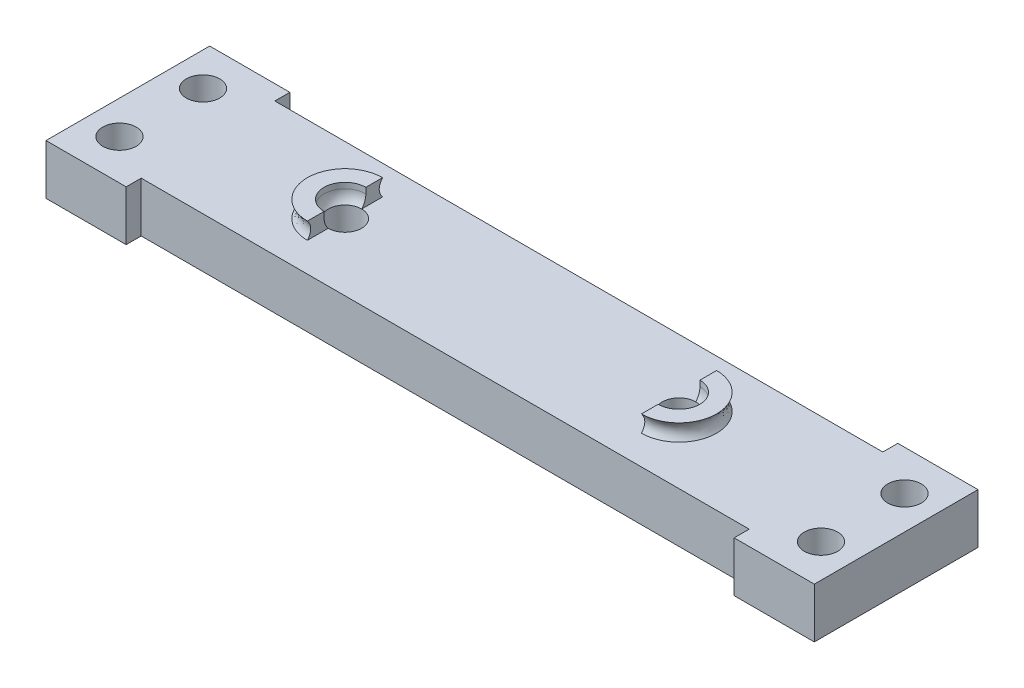
ISO-10303-21;
HEADER;
FILE_DESCRIPTION(('STEP AP214'),'2;1');
FILE_NAME('part.step','',(''),(''),'','','');
FILE_SCHEMA(('AUTOMOTIVE_DESIGN { 1 0 10303 214 1 1 1 1 }'));
ENDSEC;
DATA;
#1=APPLICATION_CONTEXT('core data for automotive mechanical design processes');
#2=APPLICATION_PROTOCOL_DEFINITION('international standard','automotive_design',2000,#1);
#3=PRODUCT_CONTEXT('',#1,'mechanical');
#4=PRODUCT('Part','Part','',(#3));
#5=PRODUCT_RELATED_PRODUCT_CATEGORY('part','',(#4));
#6=PRODUCT_DEFINITION_FORMATION('','',#4);
#7=PRODUCT_DEFINITION_CONTEXT('part definition',#1,'design');
#8=PRODUCT_DEFINITION('design','',#6,#7);
#9=PRODUCT_DEFINITION_SHAPE('','',#8);
#10=(LENGTH_UNIT() NAMED_UNIT(*) SI_UNIT(.MILLI.,.METRE.));
#11=(NAMED_UNIT(*) PLANE_ANGLE_UNIT() SI_UNIT($,.RADIAN.));
#12=(NAMED_UNIT(*) SI_UNIT($,.STERADIAN.) SOLID_ANGLE_UNIT());
#13=UNCERTAINTY_MEASURE_WITH_UNIT(LENGTH_MEASURE(1.E-05),#10,'distance_accuracy_value','');
#14=(GEOMETRIC_REPRESENTATION_CONTEXT(3) GLOBAL_UNCERTAINTY_ASSIGNED_CONTEXT((#13)) GLOBAL_UNIT_ASSIGNED_CONTEXT((#10,
#11,#12)) REPRESENTATION_CONTEXT('',''));
#15=CARTESIAN_POINT('',(0.,0.,0.));
#16=DIRECTION('',(0.,0.,1.));
#17=DIRECTION('',(1.,0.,0.));
#18=AXIS2_PLACEMENT_3D('',#15,#16,#17);
#19=CARTESIAN_POINT('',(3.00570826429431,5.,1.75));
#20=DIRECTION('',(1.,0.,0.));
#21=DIRECTION('',(0.,0.,-1.));
#22=AXIS2_PLACEMENT_3D('',#19,#20,#21);
#23=PLANE('',#22);
#24=CARTESIAN_POINT('',(3.00570826429431,4.,1.75));
#25=CARTESIAN_POINT('',(3.00570826429431,4.5,2.15));
#26=CARTESIAN_POINT('',(3.00570826429431,5.,1.75));
#27=B_SPLINE_CURVE_WITH_KNOTS('',2,(#24,#25,#26),.UNSPECIFIED.,.F.,.F.,(3,3),(0.,1.),.UNSPECIFIED.);
#28=CARTESIAN_POINT('',(3.00570826429431,4.,1.75));
#29=VERTEX_POINT('',#28);
#30=CARTESIAN_POINT('',(3.00570826429431,5.,1.75));
#31=VERTEX_POINT('',#30);
#32=EDGE_CURVE('E314',#29,#31,#27,.T.);
#33=ORIENTED_EDGE('',*,*,#32,.F.);
#34=DIRECTION('',(0.,0.,1.));
#35=VECTOR('',#34,1.);
#36=CARTESIAN_POINT('',(3.00570826429431,4.,1.75));
#37=LINE('',#36,#35);
#38=CARTESIAN_POINT('',(3.00570826429431,4.,3.00000000000001));
#39=VERTEX_POINT('',#38);
#40=EDGE_CURVE('E49',#29,#39,#37,.T.);
#41=ORIENTED_EDGE('',*,*,#40,.T.);
#42=CARTESIAN_POINT('',(3.00570826429431,4.66143782776615,3.75));
#43=DIRECTION('',(1.,0.,0.));
#44=DIRECTION('',(0.,0.,-1.));
#45=AXIS2_PLACEMENT_3D('',#42,#43,#44);
#46=CIRCLE('',#45,1.);
#47=CARTESIAN_POINT('',(3.00570826429431,4.66143782776615,2.75));
#48=VERTEX_POINT('',#47);
#49=EDGE_CURVE('E11',#39,#48,#46,.T.);
#50=ORIENTED_EDGE('',*,*,#49,.T.);
#51=DIRECTION('',(0.,-1.,0.));
#52=VECTOR('',#51,1.);
#53=CARTESIAN_POINT('',(3.00570826429431,5.,2.75));
#54=LINE('',#53,#52);
#55=CARTESIAN_POINT('',(3.00570826429431,5.,2.75));
#56=VERTEX_POINT('',#55);
#57=EDGE_CURVE('E353',#56,#48,#54,.T.);
#58=ORIENTED_EDGE('',*,*,#57,.F.);
#59=DIRECTION('',(0.,0.,1.));
#60=VECTOR('',#59,1.);
#61=CARTESIAN_POINT('',(3.00570826429431,5.,1.75));
#62=LINE('',#61,#60);
#63=EDGE_CURVE('E340',#31,#56,#62,.T.);
#64=ORIENTED_EDGE('',*,*,#63,.F.);
#65=EDGE_LOOP('',(#33,#41,#50,#58,#64));
#66=FACE_BOUND('',#65,.T.);
#67=ADVANCED_FACE('F35',(#66),#23,.F.);
#68=CARTESIAN_POINT('',(3.00570826429431,5.,5.25));
#69=DIRECTION('',(1.,0.,0.));
#70=DIRECTION('',(0.,0.,-1.));
#71=AXIS2_PLACEMENT_3D('',#68,#69,#70);
#72=PLANE('',#71);
#73=CARTESIAN_POINT('',(3.00570826429431,4.,6.25000000000001));
#74=CARTESIAN_POINT('',(3.00570826429431,4.5,5.85000000000001));
#75=CARTESIAN_POINT('',(3.00570826429431,5.,6.25000000000001));
#76=B_SPLINE_CURVE_WITH_KNOTS('',2,(#73,#74,#75),.UNSPECIFIED.,.F.,.F.,(3,3),(0.,1.),.UNSPECIFIED.);
#77=CARTESIAN_POINT('',(3.00570826429431,5.,6.25000000000001));
#78=VERTEX_POINT('',#77);
#79=CARTESIAN_POINT('',(3.00570826429431,4.,6.25000000000001));
#80=VERTEX_POINT('',#79);
#81=EDGE_CURVE('E284',#78,#80,#76,.F.);
#82=ORIENTED_EDGE('',*,*,#81,.F.);
#83=DIRECTION('',(0.,0.,1.));
#84=VECTOR('',#83,1.);
#85=CARTESIAN_POINT('',(3.00570826429431,5.,5.25));
#86=LINE('',#85,#84);
#87=CARTESIAN_POINT('',(3.00570826429431,5.,5.25000000000001));
#88=VERTEX_POINT('',#87);
#89=EDGE_CURVE('E344',#88,#78,#86,.T.);
#90=ORIENTED_EDGE('',*,*,#89,.F.);
#91=DIRECTION('',(0.,-1.,0.));
#92=VECTOR('',#91,1.);
#93=CARTESIAN_POINT('',(3.00570826429431,5.,5.25000000000001));
#94=LINE('',#93,#92);
#95=CARTESIAN_POINT('',(3.00570826429431,4.66143782776615,5.25000000000001));
#96=VERTEX_POINT('',#95);
#97=EDGE_CURVE('E347',#88,#96,#94,.T.);
#98=ORIENTED_EDGE('',*,*,#97,.T.);
#99=CARTESIAN_POINT('',(3.00570826429431,4.66143782776615,4.25000000000001));
#100=DIRECTION('',(1.,0.,0.));
#101=DIRECTION('',(0.,0.,-1.));
#102=AXIS2_PLACEMENT_3D('',#99,#100,#101);
#103=CIRCLE('',#102,1.);
#104=CARTESIAN_POINT('',(3.00570826429431,4.,5.00000000000001));
#105=VERTEX_POINT('',#104);
#106=EDGE_CURVE('E43',#96,#105,#103,.T.);
#107=ORIENTED_EDGE('',*,*,#106,.T.);
#108=DIRECTION('',(0.,0.,1.));
#109=VECTOR('',#108,1.);
#110=CARTESIAN_POINT('',(3.00570826429431,4.,5.25));
#111=LINE('',#110,#109);
#112=EDGE_CURVE('E56',#105,#80,#111,.T.);
#113=ORIENTED_EDGE('',*,*,#112,.T.);
#114=EDGE_LOOP('',(#82,#90,#98,#107,#113));
#115=FACE_BOUND('',#114,.T.);
#116=ADVANCED_FACE('F422',(#115),#72,.F.);
#117=CARTESIAN_POINT('',(0.,4.,0.));
#118=DIRECTION('',(0.,1.,0.));
#119=DIRECTION('',(0.,0.,1.));
#120=AXIS2_PLACEMENT_3D('',#117,#118,#119);
#121=PLANE('',#120);
#122=DIRECTION('',(0.,0.,-1.));
#123=VECTOR('',#122,1.);
#124=CARTESIAN_POINT('',(-16.9942917357057,4.,1.75000000000001));
#125=LINE('',#124,#123);
#126=CARTESIAN_POINT('',(-16.9942917357057,4.,3.));
#127=VERTEX_POINT('',#126);
#128=CARTESIAN_POINT('',(-16.9942917357057,4.,1.75000000000001));
#129=VERTEX_POINT('',#128);
#130=EDGE_CURVE('E361',#127,#129,#125,.T.);
#131=ORIENTED_EDGE('',*,*,#130,.F.);
#132=CARTESIAN_POINT('',(-16.9942917357057,4.,4.00000000000001));
#133=DIRECTION('',(0.,1.,0.));
#134=DIRECTION('',(0.,0.,1.));
#135=AXIS2_PLACEMENT_3D('',#132,#133,#134);
#136=CIRCLE('',#135,1.);
#137=CARTESIAN_POINT('',(-16.9942917357057,4.,5.00000000000001));
#138=VERTEX_POINT('',#137);
#139=EDGE_CURVE('E246',#138,#127,#136,.T.);
#140=ORIENTED_EDGE('',*,*,#139,.F.);
#141=DIRECTION('',(0.,0.,-1.));
#142=VECTOR('',#141,1.);
#143=CARTESIAN_POINT('',(-16.9942917357057,4.,6.25000000000001));
#144=LINE('',#143,#142);
#145=CARTESIAN_POINT('',(-16.9942917357057,4.,6.25000000000001));
#146=VERTEX_POINT('',#145);
#147=EDGE_CURVE('E370',#146,#138,#144,.T.);
#148=ORIENTED_EDGE('',*,*,#147,.F.);
#149=CARTESIAN_POINT('',(-16.9942917357057,4.,4.00000000000001));
#150=DIRECTION('',(0.,1.,0.));
#151=DIRECTION('',(0.,0.,1.));
#152=AXIS2_PLACEMENT_3D('',#149,#150,#151);
#153=CIRCLE('',#152,2.25);
#154=EDGE_CURVE('E356',#129,#146,#153,.T.);
#155=ORIENTED_EDGE('',*,*,#154,.F.);
#156=EDGE_LOOP('',(#131,#140,#148,#155));
#157=FACE_BOUND('',#156,.T.);
#158=ORIENTED_EDGE('',*,*,#112,.F.);
#159=CARTESIAN_POINT('',(3.00570826429431,4.,4.00000000000001));
#160=DIRECTION('',(0.,1.,0.));
#161=DIRECTION('',(0.,0.,1.));
#162=AXIS2_PLACEMENT_3D('',#159,#160,#161);
#163=CIRCLE('',#162,1.);
#164=EDGE_CURVE('E249',#39,#105,#163,.T.);
#165=ORIENTED_EDGE('',*,*,#164,.F.);
#166=ORIENTED_EDGE('',*,*,#40,.F.);
#167=CARTESIAN_POINT('',(3.00570826429431,4.,4.00000000000001));
#168=DIRECTION('',(0.,1.,0.));
#169=DIRECTION('',(0.,0.,-1.));
#170=AXIS2_PLACEMENT_3D('',#167,#168,#169);
#171=CIRCLE('',#170,2.25);
#172=EDGE_CURVE('E333',#80,#29,#171,.T.);
#173=ORIENTED_EDGE('',*,*,#172,.F.);
#174=EDGE_LOOP('',(#158,#165,#166,#173));
#175=FACE_BOUND('',#174,.T.);
#176=DIRECTION('',(1.,0.,0.));
#177=VECTOR('',#176,1.);
#178=CARTESIAN_POINT('',(0.,4.,-0.899999999999998));
#179=LINE('',#178,#177);
#180=CARTESIAN_POINT('',(-29.9942917357057,4.,-0.900000000000001));
#181=VERTEX_POINT('',#180);
#182=CARTESIAN_POINT('',(-25.1942917357057,4.,-0.900000000000001));
#183=VERTEX_POINT('',#182);
#184=EDGE_CURVE('E194',#181,#183,#179,.T.);
#185=ORIENTED_EDGE('',*,*,#184,.F.);
#186=DIRECTION('',(0.,0.,1.));
#187=VECTOR('',#186,1.);
#188=CARTESIAN_POINT('',(-29.9942917357057,4.,-0.999999999999999));
#189=LINE('',#188,#187);
#190=CARTESIAN_POINT('',(-29.9942917357057,4.,8.90000000000001));
#191=VERTEX_POINT('',#190);
#192=EDGE_CURVE('E191',#181,#191,#189,.T.);
#193=ORIENTED_EDGE('',*,*,#192,.T.);
#194=DIRECTION('',(-1.,0.,0.));
#195=VECTOR('',#194,1.);
#196=CARTESIAN_POINT('',(0.,4.,8.90000000000001));
#197=LINE('',#196,#195);
#198=CARTESIAN_POINT('',(-25.1942917357057,4.,8.90000000000001));
#199=VERTEX_POINT('',#198);
#200=EDGE_CURVE('E255',#199,#191,#197,.T.);
#201=ORIENTED_EDGE('',*,*,#200,.F.);
#202=DIRECTION('',(0.,0.,1.));
#203=VECTOR('',#202,1.);
#204=CARTESIAN_POINT('',(-25.1942917357057,4.,0.));
#205=LINE('',#204,#203);
#206=CARTESIAN_POINT('',(-25.1942917357057,4.,8.00000000000001));
#207=VERTEX_POINT('',#206);
#208=EDGE_CURVE('E281',#207,#199,#205,.T.);
#209=ORIENTED_EDGE('',*,*,#208,.F.);
#210=DIRECTION('',(1.,0.,0.));
#211=VECTOR('',#210,1.);
#212=CARTESIAN_POINT('',(11.0057082642943,4.,8.));
#213=LINE('',#212,#211);
#214=CARTESIAN_POINT('',(11.2057082642943,4.,8.));
#215=VERTEX_POINT('',#214);
#216=EDGE_CURVE('E392',#207,#215,#213,.T.);
#217=ORIENTED_EDGE('',*,*,#216,.T.);
#218=DIRECTION('',(0.,0.,-1.));
#219=VECTOR('',#218,1.);
#220=CARTESIAN_POINT('',(11.2057082642943,4.,0.));
#221=LINE('',#220,#219);
#222=CARTESIAN_POINT('',(11.2057082642943,4.,8.9));
#223=VERTEX_POINT('',#222);
#224=EDGE_CURVE('E273',#223,#215,#221,.T.);
#225=ORIENTED_EDGE('',*,*,#224,.F.);
#226=DIRECTION('',(-1.,0.,0.));
#227=VECTOR('',#226,1.);
#228=CARTESIAN_POINT('',(0.,4.,8.9));
#229=LINE('',#228,#227);
#230=CARTESIAN_POINT('',(16.0057082642943,4.,8.9));
#231=VERTEX_POINT('',#230);
#232=EDGE_CURVE('E264',#231,#223,#229,.T.);
#233=ORIENTED_EDGE('',*,*,#232,.F.);
#234=DIRECTION('',(0.,0.,-1.));
#235=VECTOR('',#234,1.);
#236=CARTESIAN_POINT('',(16.0057082642943,4.,9.));
#237=LINE('',#236,#235);
#238=CARTESIAN_POINT('',(16.0057082642943,4.,-0.900000000000004));
#239=VERTEX_POINT('',#238);
#240=EDGE_CURVE('E395',#231,#239,#237,.T.);
#241=ORIENTED_EDGE('',*,*,#240,.T.);
#242=DIRECTION('',(1.,0.,0.));
#243=VECTOR('',#242,1.);
#244=CARTESIAN_POINT('',(0.,4.,-0.900000000000004));
#245=LINE('',#244,#243);
#246=CARTESIAN_POINT('',(11.2057082642943,4.,-0.900000000000004));
#247=VERTEX_POINT('',#246);
#248=EDGE_CURVE('E260',#247,#239,#245,.T.);
#249=ORIENTED_EDGE('',*,*,#248,.F.);
#250=DIRECTION('',(0.,0.,-1.));
#251=VECTOR('',#250,1.);
#252=CARTESIAN_POINT('',(11.2057082642943,4.,0.));
#253=LINE('',#252,#251);
#254=CARTESIAN_POINT('',(11.2057082642943,4.,0.));
#255=VERTEX_POINT('',#254);
#256=EDGE_CURVE('E268',#255,#247,#253,.T.);
#257=ORIENTED_EDGE('',*,*,#256,.F.);
#258=DIRECTION('',(-1.,0.,0.));
#259=VECTOR('',#258,1.);
#260=CARTESIAN_POINT('',(-24.9942917357057,4.,0.));
#261=LINE('',#260,#259);
#262=CARTESIAN_POINT('',(-25.1942917357057,4.,0.));
#263=VERTEX_POINT('',#262);
#264=EDGE_CURVE('E398',#255,#263,#261,.T.);
#265=ORIENTED_EDGE('',*,*,#264,.T.);
#266=DIRECTION('',(0.,0.,1.));
#267=VECTOR('',#266,1.);
#268=CARTESIAN_POINT('',(-25.1942917357057,4.,0.));
#269=LINE('',#268,#267);
#270=EDGE_CURVE('E277',#183,#263,#269,.T.);
#271=ORIENTED_EDGE('',*,*,#270,.F.);
#272=EDGE_LOOP('',(#185,#193,#201,#209,#217,#225,#233,#241,#249,#257,#265,#271));
#273=FACE_BOUND('',#272,.T.);
#274=CARTESIAN_POINT('',(14.0057082642943,4.,6.5));
#275=DIRECTION('',(0.,1.,0.));
#276=DIRECTION('',(0.,0.,1.));
#277=AXIS2_PLACEMENT_3D('',#274,#275,#276);
#278=CIRCLE('',#277,1.);
#279=CARTESIAN_POINT('',(14.0057082642943,4.,7.50000000000001));
#280=VERTEX_POINT('',#279);
#281=EDGE_CURVE('E379',#280,#280,#278,.T.);
#282=ORIENTED_EDGE('',*,*,#281,.F.);
#283=EDGE_LOOP('',(#282));
#284=FACE_BOUND('',#283,.T.);
#285=CARTESIAN_POINT('',(-27.9942917357057,4.,1.5));
#286=DIRECTION('',(0.,1.,0.));
#287=DIRECTION('',(0.,0.,1.));
#288=AXIS2_PLACEMENT_3D('',#285,#286,#287);
#289=CIRCLE('',#288,1.);
#290=CARTESIAN_POINT('',(-27.9942917357057,4.,2.5));
#291=VERTEX_POINT('',#290);
#292=EDGE_CURVE('E385',#291,#291,#289,.T.);
#293=ORIENTED_EDGE('',*,*,#292,.F.);
#294=EDGE_LOOP('',(#293));
#295=FACE_BOUND('',#294,.T.);
#296=CARTESIAN_POINT('',(-27.9942917357057,4.,6.5));
#297=DIRECTION('',(0.,1.,0.));
#298=DIRECTION('',(0.,0.,1.));
#299=AXIS2_PLACEMENT_3D('',#296,#297,#298);
#300=CIRCLE('',#299,1.);
#301=CARTESIAN_POINT('',(-27.9942917357057,4.,7.50000000000001));
#302=VERTEX_POINT('',#301);
#303=EDGE_CURVE('E388',#302,#302,#300,.T.);
#304=ORIENTED_EDGE('',*,*,#303,.F.);
#305=EDGE_LOOP('',(#304));
#306=FACE_BOUND('',#305,.T.);
#307=CARTESIAN_POINT('',(14.0057082642943,4.,1.5));
#308=DIRECTION('',(0.,1.,0.));
#309=DIRECTION('',(0.,0.,1.));
#310=AXIS2_PLACEMENT_3D('',#307,#308,#309);
#311=CIRCLE('',#310,1.);
#312=CARTESIAN_POINT('',(14.0057082642943,4.,2.5));
#313=VERTEX_POINT('',#312);
#314=EDGE_CURVE('E382',#313,#313,#311,.T.);
#315=ORIENTED_EDGE('',*,*,#314,.F.);
#316=EDGE_LOOP('',(#315));
#317=FACE_BOUND('',#316,.T.);
#318=ADVANCED_FACE('F438',(#157,#175,#273,#284,#295,#306,#317),#121,.T.);
#319=CARTESIAN_POINT('',(-29.9942917357057,4.,-0.999999999999999));
#320=DIRECTION('',(1.,0.,0.));
#321=DIRECTION('',(0.,0.,-1.));
#322=AXIS2_PLACEMENT_3D('',#319,#320,#321);
#323=PLANE('',#322);
#324=ORIENTED_EDGE('',*,*,#192,.F.);
#325=DIRECTION('',(0.,-1.,0.));
#326=VECTOR('',#325,1.);
#327=CARTESIAN_POINT('',(-29.9942917357057,7.,-0.900000000000001));
#328=LINE('',#327,#326);
#329=CARTESIAN_POINT('',(-29.9942917357057,1.,-0.900000000000001));
#330=VERTEX_POINT('',#329);
#331=EDGE_CURVE('E185',#181,#330,#328,.T.);
#332=ORIENTED_EDGE('',*,*,#331,.T.);
#333=DIRECTION('',(0.,0.,-1.));
#334=VECTOR('',#333,1.);
#335=CARTESIAN_POINT('',(-29.9942917357057,1.,-0.900000000000001));
#336=LINE('',#335,#334);
#337=CARTESIAN_POINT('',(-29.9942917357057,1.,8.90000000000001));
#338=VERTEX_POINT('',#337);
#339=EDGE_CURVE('E190',#338,#330,#336,.T.);
#340=ORIENTED_EDGE('',*,*,#339,.F.);
#341=DIRECTION('',(0.,-1.,0.));
#342=VECTOR('',#341,1.);
#343=CARTESIAN_POINT('',(-29.9942917357057,7.,8.90000000000001));
#344=LINE('',#343,#342);
#345=EDGE_CURVE('E253',#191,#338,#344,.T.);
#346=ORIENTED_EDGE('',*,*,#345,.F.);
#347=EDGE_LOOP('',(#324,#332,#340,#346));
#348=FACE_BOUND('',#347,.T.);
#349=ADVANCED_FACE('F187',(#348),#323,.F.);
#350=CARTESIAN_POINT('',(11.0057082642943,4.,8.));
#351=DIRECTION('',(0.,0.,-1.));
#352=DIRECTION('',(-1.,0.,0.));
#353=AXIS2_PLACEMENT_3D('',#350,#351,#352);
#354=PLANE('',#353);
#355=DIRECTION('',(0.,-1.,0.));
#356=VECTOR('',#355,1.);
#357=CARTESIAN_POINT('',(-25.1942917357057,7.,8.00000000000001));
#358=LINE('',#357,#356);
#359=CARTESIAN_POINT('',(-25.1942917357057,1.,8.00000000000001));
#360=VERTEX_POINT('',#359);
#361=EDGE_CURVE('E279',#207,#360,#358,.T.);
#362=ORIENTED_EDGE('',*,*,#361,.T.);
#363=DIRECTION('',(-1.,0.,0.));
#364=VECTOR('',#363,1.);
#365=CARTESIAN_POINT('',(-25.1942917357057,1.,8.00000000000001));
#366=LINE('',#365,#364);
#367=CARTESIAN_POINT('',(11.2057082642943,1.,8.));
#368=VERTEX_POINT('',#367);
#369=EDGE_CURVE('E239',#368,#360,#366,.T.);
#370=ORIENTED_EDGE('',*,*,#369,.F.);
#371=DIRECTION('',(0.,-1.,0.));
#372=VECTOR('',#371,1.);
#373=CARTESIAN_POINT('',(11.2057082642943,7.,8.));
#374=LINE('',#373,#372);
#375=EDGE_CURVE('E271',#215,#368,#374,.T.);
#376=ORIENTED_EDGE('',*,*,#375,.F.);
#377=ORIENTED_EDGE('',*,*,#216,.F.);
#378=EDGE_LOOP('',(#362,#370,#376,#377));
#379=FACE_BOUND('',#378,.T.);
#380=ADVANCED_FACE('F534',(#379),#354,.F.);
#381=CARTESIAN_POINT('',(16.0057082642943,4.,9.));
#382=DIRECTION('',(-1.,0.,0.));
#383=DIRECTION('',(0.,0.,1.));
#384=AXIS2_PLACEMENT_3D('',#381,#382,#383);
#385=PLANE('',#384);
#386=DIRECTION('',(0.,-1.,0.));
#387=VECTOR('',#386,1.);
#388=CARTESIAN_POINT('',(16.0057082642943,7.,8.9));
#389=LINE('',#388,#387);
#390=CARTESIAN_POINT('',(16.0057082642943,1.,8.9));
#391=VERTEX_POINT('',#390);
#392=EDGE_CURVE('E262',#231,#391,#389,.T.);
#393=ORIENTED_EDGE('',*,*,#392,.T.);
#394=DIRECTION('',(0.,0.,1.));
#395=VECTOR('',#394,1.);
#396=CARTESIAN_POINT('',(16.0057082642943,1.,8.9));
#397=LINE('',#396,#395);
#398=CARTESIAN_POINT('',(16.0057082642943,1.,-0.900000000000004));
#399=VERTEX_POINT('',#398);
#400=EDGE_CURVE('E230',#399,#391,#397,.T.);
#401=ORIENTED_EDGE('',*,*,#400,.F.);
#402=DIRECTION('',(0.,-1.,0.));
#403=VECTOR('',#402,1.);
#404=CARTESIAN_POINT('',(16.0057082642943,7.,-0.900000000000004));
#405=LINE('',#404,#403);
#406=EDGE_CURVE('E258',#239,#399,#405,.T.);
#407=ORIENTED_EDGE('',*,*,#406,.F.);
#408=ORIENTED_EDGE('',*,*,#240,.F.);
#409=EDGE_LOOP('',(#393,#401,#407,#408));
#410=FACE_BOUND('',#409,.T.);
#411=ADVANCED_FACE('F530',(#410),#385,.F.);
#412=CARTESIAN_POINT('',(-24.9942917357057,4.,0.));
#413=DIRECTION('',(0.,0.,1.));
#414=DIRECTION('',(1.,0.,0.));
#415=AXIS2_PLACEMENT_3D('',#412,#413,#414);
#416=PLANE('',#415);
#417=DIRECTION('',(0.,-1.,0.));
#418=VECTOR('',#417,1.);
#419=CARTESIAN_POINT('',(11.2057082642943,7.,0.));
#420=LINE('',#419,#418);
#421=CARTESIAN_POINT('',(11.2057082642943,1.,0.));
#422=VERTEX_POINT('',#421);
#423=EDGE_CURVE('E266',#255,#422,#420,.T.);
#424=ORIENTED_EDGE('',*,*,#423,.T.);
#425=DIRECTION('',(1.,0.,0.));
#426=VECTOR('',#425,1.);
#427=CARTESIAN_POINT('',(11.2057082642943,1.,0.));
#428=LINE('',#427,#426);
#429=CARTESIAN_POINT('',(-25.1942917357057,1.,0.));
#430=VERTEX_POINT('',#429);
#431=EDGE_CURVE('E221',#430,#422,#428,.T.);
#432=ORIENTED_EDGE('',*,*,#431,.F.);
#433=DIRECTION('',(0.,-1.,0.));
#434=VECTOR('',#433,1.);
#435=CARTESIAN_POINT('',(-25.1942917357057,7.,0.));
#436=LINE('',#435,#434);
#437=EDGE_CURVE('E275',#263,#430,#436,.T.);
#438=ORIENTED_EDGE('',*,*,#437,.F.);
#439=ORIENTED_EDGE('',*,*,#264,.F.);
#440=EDGE_LOOP('',(#424,#432,#438,#439));
#441=FACE_BOUND('',#440,.T.);
#442=ADVANCED_FACE('F525',(#441),#416,.F.);
#443=CARTESIAN_POINT('',(-27.9942917357057,4.,6.5));
#444=DIRECTION('',(0.,-1.,0.));
#445=DIRECTION('',(0.,0.,-1.));
#446=AXIS2_PLACEMENT_3D('',#443,#444,#445);
#447=CYLINDRICAL_SURFACE('',#446,1.);
#448=ORIENTED_EDGE('',*,*,#303,.T.);
#449=EDGE_LOOP('',(#448));
#450=FACE_BOUND('',#449,.T.);
#451=CARTESIAN_POINT('',(-27.9942917357057,1.,6.5));
#452=DIRECTION('',(0.,-1.,0.));
#453=DIRECTION('',(0.,0.,-1.));
#454=AXIS2_PLACEMENT_3D('',#451,#452,#453);
#455=CIRCLE('',#454,1.);
#456=CARTESIAN_POINT('',(-27.9942917357057,1.,5.5));
#457=VERTEX_POINT('',#456);
#458=EDGE_CURVE('E213',#457,#457,#455,.T.);
#459=ORIENTED_EDGE('',*,*,#458,.T.);
#460=EDGE_LOOP('',(#459));
#461=FACE_BOUND('',#460,.T.);
#462=ADVANCED_FACE('F522',(#450,#461),#447,.F.);
#463=CARTESIAN_POINT('',(-27.9942917357057,4.,1.5));
#464=DIRECTION('',(0.,-1.,0.));
#465=DIRECTION('',(0.,0.,-1.));
#466=AXIS2_PLACEMENT_3D('',#463,#464,#465);
#467=CYLINDRICAL_SURFACE('',#466,1.);
#468=ORIENTED_EDGE('',*,*,#292,.T.);
#469=EDGE_LOOP('',(#468));
#470=FACE_BOUND('',#469,.T.);
#471=CARTESIAN_POINT('',(-27.9942917357057,1.,1.5));
#472=DIRECTION('',(0.,-1.,0.));
#473=DIRECTION('',(0.,0.,-1.));
#474=AXIS2_PLACEMENT_3D('',#471,#472,#473);
#475=CIRCLE('',#474,1.);
#476=CARTESIAN_POINT('',(-27.9942917357057,1.,0.500000000000002));
#477=VERTEX_POINT('',#476);
#478=EDGE_CURVE('E216',#477,#477,#475,.T.);
#479=ORIENTED_EDGE('',*,*,#478,.T.);
#480=EDGE_LOOP('',(#479));
#481=FACE_BOUND('',#480,.T.);
#482=ADVANCED_FACE('F457',(#470,#481),#467,.F.);
#483=CARTESIAN_POINT('',(14.0057082642943,4.,1.5));
#484=DIRECTION('',(0.,-1.,0.));
#485=DIRECTION('',(0.,0.,-1.));
#486=AXIS2_PLACEMENT_3D('',#483,#484,#485);
#487=CYLINDRICAL_SURFACE('',#486,1.);
#488=ORIENTED_EDGE('',*,*,#314,.T.);
#489=EDGE_LOOP('',(#488));
#490=FACE_BOUND('',#489,.T.);
#491=CARTESIAN_POINT('',(14.0057082642943,1.,1.5));
#492=DIRECTION('',(0.,-1.,0.));
#493=DIRECTION('',(0.,0.,-1.));
#494=AXIS2_PLACEMENT_3D('',#491,#492,#493);
#495=CIRCLE('',#494,1.);
#496=CARTESIAN_POINT('',(14.0057082642943,1.,0.500000000000002));
#497=VERTEX_POINT('',#496);
#498=EDGE_CURVE('E461',#497,#497,#495,.T.);
#499=ORIENTED_EDGE('',*,*,#498,.T.);
#500=EDGE_LOOP('',(#499));
#501=FACE_BOUND('',#500,.T.);
#502=ADVANCED_FACE('F453',(#490,#501),#487,.F.);
#503=CARTESIAN_POINT('',(14.0057082642943,4.,6.5));
#504=DIRECTION('',(0.,-1.,0.));
#505=DIRECTION('',(0.,0.,-1.));
#506=AXIS2_PLACEMENT_3D('',#503,#504,#505);
#507=CYLINDRICAL_SURFACE('',#506,1.);
#508=ORIENTED_EDGE('',*,*,#281,.T.);
#509=EDGE_LOOP('',(#508));
#510=FACE_BOUND('',#509,.T.);
#511=CARTESIAN_POINT('',(14.0057082642943,1.,6.5));
#512=DIRECTION('',(0.,-1.,0.));
#513=DIRECTION('',(0.,0.,-1.));
#514=AXIS2_PLACEMENT_3D('',#511,#512,#513);
#515=CIRCLE('',#514,1.);
#516=CARTESIAN_POINT('',(14.0057082642943,1.,5.5));
#517=VERTEX_POINT('',#516);
#518=EDGE_CURVE('E463',#517,#517,#515,.T.);
#519=ORIENTED_EDGE('',*,*,#518,.T.);
#520=EDGE_LOOP('',(#519));
#521=FACE_BOUND('',#520,.T.);
#522=ADVANCED_FACE('F456',(#510,#521),#507,.F.);
#523=CARTESIAN_POINT('',(-16.9942917357057,5.,6.25000000000001));
#524=DIRECTION('',(-1.,0.,0.));
#525=DIRECTION('',(0.,0.,1.));
#526=AXIS2_PLACEMENT_3D('',#523,#524,#525);
#527=PLANE('',#526);
#528=DIRECTION('',(0.,0.,-1.));
#529=VECTOR('',#528,1.);
#530=CARTESIAN_POINT('',(-16.9942917357057,5.,6.25000000000001));
#531=LINE('',#530,#529);
#532=CARTESIAN_POINT('',(-16.9942917357057,5.,6.25000000000001));
#533=VERTEX_POINT('',#532);
#534=CARTESIAN_POINT('',(-16.9942917357057,5.,5.25000000000001));
#535=VERTEX_POINT('',#534);
#536=EDGE_CURVE('E360',#533,#535,#531,.T.);
#537=ORIENTED_EDGE('',*,*,#536,.F.);
#538=CARTESIAN_POINT('',(-16.9942917357057,5.,6.25));
#539=CARTESIAN_POINT('',(-16.9942917357057,4.5,5.85));
#540=CARTESIAN_POINT('',(-16.9942917357057,4.,6.25));
#541=B_SPLINE_CURVE_WITH_KNOTS('',2,(#538,#539,#540),.UNSPECIFIED.,.F.,.F.,(3,3),(0.,1.),.UNSPECIFIED.);
#542=EDGE_CURVE('E325',#533,#146,#541,.T.);
#543=ORIENTED_EDGE('',*,*,#542,.T.);
#544=ORIENTED_EDGE('',*,*,#147,.T.);
#545=CARTESIAN_POINT('',(-16.9942917357057,4.66143782776615,4.25000000000001));
#546=DIRECTION('',(-1.,0.,0.));
#547=DIRECTION('',(0.,0.,1.));
#548=AXIS2_PLACEMENT_3D('',#545,#546,#547);
#549=CIRCLE('',#548,1.);
#550=CARTESIAN_POINT('',(-16.9942917357057,4.66143782776615,5.25000000000001));
#551=VERTEX_POINT('',#550);
#552=EDGE_CURVE('E415',#138,#551,#549,.T.);
#553=ORIENTED_EDGE('',*,*,#552,.T.);
#554=DIRECTION('',(0.,-1.,0.));
#555=VECTOR('',#554,1.);
#556=CARTESIAN_POINT('',(-16.9942917357057,5.,5.25000000000001));
#557=LINE('',#556,#555);
#558=EDGE_CURVE('E376',#535,#551,#557,.T.);
#559=ORIENTED_EDGE('',*,*,#558,.F.);
#560=EDGE_LOOP('',(#537,#543,#544,#553,#559));
#561=FACE_BOUND('',#560,.T.);
#562=ADVANCED_FACE('F512',(#561),#527,.F.);
#563=CARTESIAN_POINT('',(-16.9942917357057,5.,4.00000000000001));
#564=DIRECTION('',(0.,-1.,0.));
#565=DIRECTION('',(0.,0.,-1.));
#566=AXIS2_PLACEMENT_3D('',#563,#564,#565);
#567=CYLINDRICAL_SURFACE('',#566,1.25);
#568=ORIENTED_EDGE('',*,*,#558,.T.);
#569=CARTESIAN_POINT('',(-16.9942917357057,4.66143782776615,4.00000000000001));
#570=DIRECTION('',(0.,-1.,0.));
#571=DIRECTION('',(0.,0.,-1.));
#572=AXIS2_PLACEMENT_3D('',#569,#570,#571);
#573=CIRCLE('',#572,1.25);
#574=CARTESIAN_POINT('',(-16.9942917357057,4.66143782776615,2.75));
#575=VERTEX_POINT('',#574);
#576=EDGE_CURVE('E409',#551,#575,#573,.T.);
#577=ORIENTED_EDGE('',*,*,#576,.T.);
#578=DIRECTION('',(0.,-1.,0.));
#579=VECTOR('',#578,1.);
#580=CARTESIAN_POINT('',(-16.9942917357057,5.,2.75));
#581=LINE('',#580,#579);
#582=CARTESIAN_POINT('',(-16.9942917357057,5.,2.75));
#583=VERTEX_POINT('',#582);
#584=EDGE_CURVE('E368',#583,#575,#581,.T.);
#585=ORIENTED_EDGE('',*,*,#584,.F.);
#586=CARTESIAN_POINT('',(-16.9942917357057,5.,4.00000000000001));
#587=DIRECTION('',(0.,-1.,0.));
#588=DIRECTION('',(0.,0.,1.));
#589=AXIS2_PLACEMENT_3D('',#586,#587,#588);
#590=CIRCLE('',#589,1.25);
#591=EDGE_CURVE('E363',#535,#583,#590,.T.);
#592=ORIENTED_EDGE('',*,*,#591,.F.);
#593=EDGE_LOOP('',(#568,#577,#585,#592));
#594=FACE_BOUND('',#593,.T.);
#595=ADVANCED_FACE('F508',(#594),#567,.F.);
#596=CARTESIAN_POINT('',(-16.9942917357057,5.,1.75000000000001));
#597=DIRECTION('',(-1.,0.,0.));
#598=DIRECTION('',(0.,0.,1.));
#599=AXIS2_PLACEMENT_3D('',#596,#597,#598);
#600=PLANE('',#599);
#601=ORIENTED_EDGE('',*,*,#130,.T.);
#602=CARTESIAN_POINT('',(-16.9942917357057,5.,1.75000000000001));
#603=CARTESIAN_POINT('',(-16.9942917357057,4.5,2.15));
#604=CARTESIAN_POINT('',(-16.9942917357057,4.,1.75000000000001));
#605=B_SPLINE_CURVE_WITH_KNOTS('',2,(#602,#603,#604),.UNSPECIFIED.,.F.,.F.,(3,3),(0.,1.),.UNSPECIFIED.);
#606=CARTESIAN_POINT('',(-16.9942917357057,5.,1.75000000000001));
#607=VERTEX_POINT('',#606);
#608=EDGE_CURVE('E317',#129,#607,#605,.F.);
#609=ORIENTED_EDGE('',*,*,#608,.T.);
#610=DIRECTION('',(0.,0.,-1.));
#611=VECTOR('',#610,1.);
#612=CARTESIAN_POINT('',(-16.9942917357057,5.,1.75000000000001));
#613=LINE('',#612,#611);
#614=EDGE_CURVE('E365',#583,#607,#613,.T.);
#615=ORIENTED_EDGE('',*,*,#614,.F.);
#616=ORIENTED_EDGE('',*,*,#584,.T.);
#617=CARTESIAN_POINT('',(-16.9942917357057,4.66143782776615,3.75));
#618=DIRECTION('',(-1.,0.,0.));
#619=DIRECTION('',(0.,0.,1.));
#620=AXIS2_PLACEMENT_3D('',#617,#618,#619);
#621=CIRCLE('',#620,1.);
#622=EDGE_CURVE('E412',#575,#127,#621,.T.);
#623=ORIENTED_EDGE('',*,*,#622,.T.);
#624=EDGE_LOOP('',(#601,#609,#615,#616,#623));
#625=FACE_BOUND('',#624,.T.);
#626=ADVANCED_FACE('F504',(#625),#600,.F.);
#627=CARTESIAN_POINT('',(-16.9942917357057,5.,4.00000000000001));
#628=DIRECTION('',(0.,1.,0.));
#629=DIRECTION('',(0.,0.,1.));
#630=AXIS2_PLACEMENT_3D('',#627,#628,#629);
#631=PLANE('',#630);
#632=CARTESIAN_POINT('',(-16.9942917357057,5.,4.00000000000001));
#633=DIRECTION('',(0.,1.,0.));
#634=DIRECTION('',(0.,0.,1.));
#635=AXIS2_PLACEMENT_3D('',#632,#633,#634);
#636=CIRCLE('',#635,2.25);
#637=EDGE_CURVE('E357',#607,#533,#636,.T.);
#638=ORIENTED_EDGE('',*,*,#637,.T.);
#639=ORIENTED_EDGE('',*,*,#536,.T.);
#640=ORIENTED_EDGE('',*,*,#591,.T.);
#641=ORIENTED_EDGE('',*,*,#614,.T.);
#642=EDGE_LOOP('',(#638,#639,#640,#641));
#643=FACE_BOUND('',#642,.T.);
#644=ADVANCED_FACE('F501',(#643),#631,.T.);
#645=CARTESIAN_POINT('',(3.00570826429431,5.,4.00000000000001));
#646=DIRECTION('',(0.,-1.,0.));
#647=DIRECTION('',(0.,0.,-1.));
#648=AXIS2_PLACEMENT_3D('',#645,#646,#647);
#649=CYLINDRICAL_SURFACE('',#648,1.25);
#650=ORIENTED_EDGE('',*,*,#57,.T.);
#651=CARTESIAN_POINT('',(3.00570826429431,4.66143782776615,4.00000000000001));
#652=DIRECTION('',(0.,-1.,0.));
#653=DIRECTION('',(0.,0.,-1.));
#654=AXIS2_PLACEMENT_3D('',#651,#652,#653);
#655=CIRCLE('',#654,1.25);
#656=EDGE_CURVE('E417',#48,#96,#655,.T.);
#657=ORIENTED_EDGE('',*,*,#656,.T.);
#658=ORIENTED_EDGE('',*,*,#97,.F.);
#659=CARTESIAN_POINT('',(3.00570826429431,5.,4.00000000000001));
#660=DIRECTION('',(0.,-1.,0.));
#661=DIRECTION('',(0.,0.,-1.));
#662=AXIS2_PLACEMENT_3D('',#659,#660,#661);
#663=CIRCLE('',#662,1.25);
#664=EDGE_CURVE('E342',#56,#88,#663,.T.);
#665=ORIENTED_EDGE('',*,*,#664,.F.);
#666=EDGE_LOOP('',(#650,#657,#658,#665));
#667=FACE_BOUND('',#666,.T.);
#668=ADVANCED_FACE('F436',(#667),#649,.F.);
#669=CARTESIAN_POINT('',(3.00570826429431,5.,4.00000000000001));
#670=DIRECTION('',(0.,-1.,0.));
#671=DIRECTION('',(0.,0.,-1.));
#672=AXIS2_PLACEMENT_3D('',#669,#670,#671);
#673=PLANE('',#672);
#674=CARTESIAN_POINT('',(3.00570826429431,5.,4.00000000000001));
#675=DIRECTION('',(0.,1.,0.));
#676=DIRECTION('',(0.,0.,-1.));
#677=AXIS2_PLACEMENT_3D('',#674,#675,#676);
#678=CIRCLE('',#677,2.25);
#679=EDGE_CURVE('E334',#78,#31,#678,.T.);
#680=ORIENTED_EDGE('',*,*,#679,.T.);
#681=ORIENTED_EDGE('',*,*,#63,.T.);
#682=ORIENTED_EDGE('',*,*,#664,.T.);
#683=ORIENTED_EDGE('',*,*,#89,.T.);
#684=EDGE_LOOP('',(#680,#681,#682,#683));
#685=FACE_BOUND('',#684,.T.);
#686=ADVANCED_FACE('F307',(#685),#673,.F.);
#687=CARTESIAN_POINT('',(-16.9942917357057,5.,1.75000000000001));
#688=CARTESIAN_POINT('',(-16.9942917357057,4.5,2.15));
#689=CARTESIAN_POINT('',(-16.9942917357057,4.,1.75000000000001));
#690=B_SPLINE_CURVE_WITH_KNOTS('',2,(#687,#688,#689),.UNSPECIFIED.,.F.,.F.,(3,3),(0.,1.),.UNSPECIFIED.);
#691=CARTESIAN_POINT('',(-16.9942917357057,5.,4.00000000000001));
#692=DIRECTION('',(0.,-1.,0.));
#693=AXIS1_PLACEMENT('',#691,#692);
#694=SURFACE_OF_REVOLUTION('',#690,#693);
#695=ORIENTED_EDGE('',*,*,#637,.F.);
#696=ORIENTED_EDGE('',*,*,#608,.F.);
#697=ORIENTED_EDGE('',*,*,#154,.T.);
#698=ORIENTED_EDGE('',*,*,#542,.F.);
#699=EDGE_LOOP('',(#695,#696,#697,#698));
#700=FACE_BOUND('',#699,.T.);
#701=ADVANCED_FACE('F301',(#700),#694,.T.);
#702=CARTESIAN_POINT('',(3.00570826429431,4.,1.75));
#703=CARTESIAN_POINT('',(3.00570826429431,4.5,2.15));
#704=CARTESIAN_POINT('',(3.00570826429431,5.,1.75));
#705=B_SPLINE_CURVE_WITH_KNOTS('',2,(#702,#703,#704),.UNSPECIFIED.,.F.,.F.,(3,3),(0.,1.),.UNSPECIFIED.);
#706=CARTESIAN_POINT('',(3.00570826429431,5.,4.00000000000001));
#707=DIRECTION('',(0.,-1.,0.));
#708=AXIS1_PLACEMENT('',#706,#707);
#709=SURFACE_OF_REVOLUTION('',#705,#708);
#710=ORIENTED_EDGE('',*,*,#32,.T.);
#711=ORIENTED_EDGE('',*,*,#679,.F.);
#712=ORIENTED_EDGE('',*,*,#81,.T.);
#713=ORIENTED_EDGE('',*,*,#172,.T.);
#714=EDGE_LOOP('',(#710,#711,#712,#713));
#715=FACE_BOUND('',#714,.T.);
#716=ADVANCED_FACE('F296',(#715),#709,.F.);
#717=CARTESIAN_POINT('',(-25.1942917357057,7.,8.00000000000001));
#718=DIRECTION('',(-1.,0.,0.));
#719=DIRECTION('',(0.,0.,1.));
#720=AXIS2_PLACEMENT_3D('',#717,#718,#719);
#721=PLANE('',#720);
#722=ORIENTED_EDGE('',*,*,#208,.T.);
#723=DIRECTION('',(0.,-1.,0.));
#724=VECTOR('',#723,1.);
#725=CARTESIAN_POINT('',(-25.1942917357057,7.,8.90000000000001));
#726=LINE('',#725,#724);
#727=CARTESIAN_POINT('',(-25.1942917357057,1.,8.90000000000001));
#728=VERTEX_POINT('',#727);
#729=EDGE_CURVE('E406',#199,#728,#726,.T.);
#730=ORIENTED_EDGE('',*,*,#729,.T.);
#731=DIRECTION('',(0.,0.,1.));
#732=VECTOR('',#731,1.);
#733=CARTESIAN_POINT('',(-25.1942917357057,1.,8.90000000000001));
#734=LINE('',#733,#732);
#735=EDGE_CURVE('E242',#360,#728,#734,.T.);
#736=ORIENTED_EDGE('',*,*,#735,.F.);
#737=ORIENTED_EDGE('',*,*,#361,.F.);
#738=EDGE_LOOP('',(#722,#730,#736,#737));
#739=FACE_BOUND('',#738,.T.);
#740=ADVANCED_FACE('F300',(#739),#721,.F.);
#741=CARTESIAN_POINT('',(-25.1942917357057,7.,0.));
#742=DIRECTION('',(-1.,0.,0.));
#743=DIRECTION('',(0.,0.,1.));
#744=AXIS2_PLACEMENT_3D('',#741,#742,#743);
#745=PLANE('',#744);
#746=ORIENTED_EDGE('',*,*,#437,.T.);
#747=DIRECTION('',(0.,0.,1.));
#748=VECTOR('',#747,1.);
#749=CARTESIAN_POINT('',(-25.1942917357057,1.,0.));
#750=LINE('',#749,#748);
#751=CARTESIAN_POINT('',(-25.1942917357057,1.,-0.900000000000001));
#752=VERTEX_POINT('',#751);
#753=EDGE_CURVE('E205',#752,#430,#750,.T.);
#754=ORIENTED_EDGE('',*,*,#753,.F.);
#755=DIRECTION('',(0.,1.,0.));
#756=VECTOR('',#755,1.);
#757=CARTESIAN_POINT('',(-25.1942917357057,7.,-0.900000000000001));
#758=LINE('',#757,#756);
#759=EDGE_CURVE('E201',#752,#183,#758,.T.);
#760=ORIENTED_EDGE('',*,*,#759,.T.);
#761=ORIENTED_EDGE('',*,*,#270,.T.);
#762=EDGE_LOOP('',(#746,#754,#760,#761));
#763=FACE_BOUND('',#762,.T.);
#764=ADVANCED_FACE('F603',(#763),#745,.F.);
#765=CARTESIAN_POINT('',(11.2057082642943,7.,9.));
#766=DIRECTION('',(1.,0.,0.));
#767=DIRECTION('',(0.,0.,-1.));
#768=AXIS2_PLACEMENT_3D('',#765,#766,#767);
#769=PLANE('',#768);
#770=ORIENTED_EDGE('',*,*,#375,.T.);
#771=DIRECTION('',(0.,0.,-1.));
#772=VECTOR('',#771,1.);
#773=CARTESIAN_POINT('',(11.2057082642943,1.,8.));
#774=LINE('',#773,#772);
#775=CARTESIAN_POINT('',(11.2057082642943,1.,8.9));
#776=VERTEX_POINT('',#775);
#777=EDGE_CURVE('E236',#776,#368,#774,.T.);
#778=ORIENTED_EDGE('',*,*,#777,.F.);
#779=DIRECTION('',(0.,1.,0.));
#780=VECTOR('',#779,1.);
#781=CARTESIAN_POINT('',(11.2057082642943,7.,8.9));
#782=LINE('',#781,#780);
#783=EDGE_CURVE('E401',#776,#223,#782,.T.);
#784=ORIENTED_EDGE('',*,*,#783,.T.);
#785=ORIENTED_EDGE('',*,*,#224,.T.);
#786=EDGE_LOOP('',(#770,#778,#784,#785));
#787=FACE_BOUND('',#786,.T.);
#788=ADVANCED_FACE('F610',(#787),#769,.F.);
#789=CARTESIAN_POINT('',(11.2057082642943,7.,-1.));
#790=DIRECTION('',(1.,0.,0.));
#791=DIRECTION('',(0.,0.,-1.));
#792=AXIS2_PLACEMENT_3D('',#789,#790,#791);
#793=PLANE('',#792);
#794=ORIENTED_EDGE('',*,*,#256,.T.);
#795=DIRECTION('',(0.,-1.,0.));
#796=VECTOR('',#795,1.);
#797=CARTESIAN_POINT('',(11.2057082642943,7.,-0.900000000000004));
#798=LINE('',#797,#796);
#799=CARTESIAN_POINT('',(11.2057082642943,1.,-0.900000000000004));
#800=VERTEX_POINT('',#799);
#801=EDGE_CURVE('E404',#247,#800,#798,.T.);
#802=ORIENTED_EDGE('',*,*,#801,.T.);
#803=DIRECTION('',(0.,0.,-1.));
#804=VECTOR('',#803,1.);
#805=CARTESIAN_POINT('',(11.2057082642943,1.,-0.900000000000004));
#806=LINE('',#805,#804);
#807=EDGE_CURVE('E224',#422,#800,#806,.T.);
#808=ORIENTED_EDGE('',*,*,#807,.F.);
#809=ORIENTED_EDGE('',*,*,#423,.F.);
#810=EDGE_LOOP('',(#794,#802,#808,#809));
#811=FACE_BOUND('',#810,.T.);
#812=ADVANCED_FACE('F617',(#811),#793,.F.);
#813=CARTESIAN_POINT('',(16.0057082642943,7.,8.9));
#814=DIRECTION('',(0.,0.,-1.));
#815=DIRECTION('',(-1.,0.,0.));
#816=AXIS2_PLACEMENT_3D('',#813,#814,#815);
#817=PLANE('',#816);
#818=ORIENTED_EDGE('',*,*,#232,.T.);
#819=ORIENTED_EDGE('',*,*,#783,.F.);
#820=DIRECTION('',(-1.,0.,0.));
#821=VECTOR('',#820,1.);
#822=CARTESIAN_POINT('',(11.2057082642943,1.,8.9));
#823=LINE('',#822,#821);
#824=EDGE_CURVE('E233',#391,#776,#823,.T.);
#825=ORIENTED_EDGE('',*,*,#824,.F.);
#826=ORIENTED_EDGE('',*,*,#392,.F.);
#827=EDGE_LOOP('',(#818,#819,#825,#826));
#828=FACE_BOUND('',#827,.T.);
#829=ADVANCED_FACE('F625',(#828),#817,.F.);
#830=CARTESIAN_POINT('',(11.2057082642943,7.,-0.900000000000004));
#831=DIRECTION('',(0.,0.,1.));
#832=DIRECTION('',(1.,0.,0.));
#833=AXIS2_PLACEMENT_3D('',#830,#831,#832);
#834=PLANE('',#833);
#835=ORIENTED_EDGE('',*,*,#248,.T.);
#836=ORIENTED_EDGE('',*,*,#406,.T.);
#837=DIRECTION('',(1.,0.,0.));
#838=VECTOR('',#837,1.);
#839=CARTESIAN_POINT('',(16.0057082642943,1.,-0.900000000000004));
#840=LINE('',#839,#838);
#841=EDGE_CURVE('E227',#800,#399,#840,.T.);
#842=ORIENTED_EDGE('',*,*,#841,.F.);
#843=ORIENTED_EDGE('',*,*,#801,.F.);
#844=EDGE_LOOP('',(#835,#836,#842,#843));
#845=FACE_BOUND('',#844,.T.);
#846=ADVANCED_FACE('F633',(#845),#834,.F.);
#847=CARTESIAN_POINT('',(-29.9942917357057,7.,8.90000000000001));
#848=DIRECTION('',(0.,0.,-1.));
#849=DIRECTION('',(-1.,0.,0.));
#850=AXIS2_PLACEMENT_3D('',#847,#848,#849);
#851=PLANE('',#850);
#852=ORIENTED_EDGE('',*,*,#200,.T.);
#853=ORIENTED_EDGE('',*,*,#345,.T.);
#854=DIRECTION('',(-1.,0.,0.));
#855=VECTOR('',#854,1.);
#856=CARTESIAN_POINT('',(-29.9942917357057,1.,8.90000000000001));
#857=LINE('',#856,#855);
#858=EDGE_CURVE('E212',#728,#338,#857,.T.);
#859=ORIENTED_EDGE('',*,*,#858,.F.);
#860=ORIENTED_EDGE('',*,*,#729,.F.);
#861=EDGE_LOOP('',(#852,#853,#859,#860));
#862=FACE_BOUND('',#861,.T.);
#863=ADVANCED_FACE('F491',(#862),#851,.F.);
#864=CARTESIAN_POINT('',(-25.1942917357057,7.,-0.900000000000001));
#865=DIRECTION('',(0.,0.,1.));
#866=DIRECTION('',(1.,0.,0.));
#867=AXIS2_PLACEMENT_3D('',#864,#865,#866);
#868=PLANE('',#867);
#869=ORIENTED_EDGE('',*,*,#184,.T.);
#870=ORIENTED_EDGE('',*,*,#759,.F.);
#871=DIRECTION('',(1.,0.,0.));
#872=VECTOR('',#871,1.);
#873=CARTESIAN_POINT('',(-25.1942917357057,1.,-0.900000000000001));
#874=LINE('',#873,#872);
#875=EDGE_CURVE('E198',#330,#752,#874,.T.);
#876=ORIENTED_EDGE('',*,*,#875,.F.);
#877=ORIENTED_EDGE('',*,*,#331,.F.);
#878=EDGE_LOOP('',(#869,#870,#876,#877));
#879=FACE_BOUND('',#878,.T.);
#880=ADVANCED_FACE('F199',(#879),#868,.F.);
#881=CARTESIAN_POINT('',(3.00570826429431,0.,4.00000000000001));
#882=DIRECTION('',(0.,1.,0.));
#883=DIRECTION('',(0.,0.,1.));
#884=AXIS2_PLACEMENT_3D('',#881,#882,#883);
#885=CYLINDRICAL_SURFACE('',#884,1.);
#886=EDGE_CURVE('E195',#105,#39,#163,.T.);
#887=ORIENTED_EDGE('',*,*,#886,.T.);
#888=ORIENTED_EDGE('',*,*,#164,.T.);
#889=EDGE_LOOP('',(#887,#888));
#890=FACE_BOUND('',#889,.T.);
#891=CARTESIAN_POINT('',(3.00570826429431,1.,4.00000000000001));
#892=DIRECTION('',(0.,-1.,0.));
#893=DIRECTION('',(0.,0.,-1.));
#894=AXIS2_PLACEMENT_3D('',#891,#892,#893);
#895=CIRCLE('',#894,1.);
#896=CARTESIAN_POINT('',(3.00570826429431,1.,3.00000000000001));
#897=VERTEX_POINT('',#896);
#898=EDGE_CURVE('E466',#897,#897,#895,.T.);
#899=ORIENTED_EDGE('',*,*,#898,.T.);
#900=EDGE_LOOP('',(#899));
#901=FACE_BOUND('',#900,.T.);
#902=ADVANCED_FACE('F429',(#890,#901),#885,.F.);
#903=CARTESIAN_POINT('',(-16.9942917357057,0.,4.00000000000001));
#904=DIRECTION('',(0.,1.,0.));
#905=DIRECTION('',(0.,0.,1.));
#906=AXIS2_PLACEMENT_3D('',#903,#904,#905);
#907=CYLINDRICAL_SURFACE('',#906,1.);
#908=ORIENTED_EDGE('',*,*,#139,.T.);
#909=EDGE_CURVE('E245',#127,#138,#136,.T.);
#910=ORIENTED_EDGE('',*,*,#909,.T.);
#911=EDGE_LOOP('',(#908,#910));
#912=FACE_BOUND('',#911,.T.);
#913=CARTESIAN_POINT('',(-16.9942917357057,1.,4.00000000000001));
#914=DIRECTION('',(0.,-1.,0.));
#915=DIRECTION('',(0.,0.,-1.));
#916=AXIS2_PLACEMENT_3D('',#913,#914,#915);
#917=CIRCLE('',#916,1.);
#918=CARTESIAN_POINT('',(-16.9942917357057,1.,3.));
#919=VERTEX_POINT('',#918);
#920=EDGE_CURVE('E471',#919,#919,#917,.T.);
#921=ORIENTED_EDGE('',*,*,#920,.T.);
#922=EDGE_LOOP('',(#921));
#923=FACE_BOUND('',#922,.T.);
#924=ADVANCED_FACE('F482',(#912,#923),#907,.F.);
#925=CARTESIAN_POINT('',(-16.9942917357057,4.66143782776615,4.00000000000001));
#926=DIRECTION('',(0.,-1.,0.));
#927=DIRECTION('',(0.,0.,-1.));
#928=AXIS2_PLACEMENT_3D('',#925,#926,#927);
#929=DEGENERATE_TOROIDAL_SURFACE('',#928,0.25,1.,.T.);
#930=ORIENTED_EDGE('',*,*,#552,.F.);
#931=ORIENTED_EDGE('',*,*,#909,.F.);
#932=ORIENTED_EDGE('',*,*,#622,.F.);
#933=ORIENTED_EDGE('',*,*,#576,.F.);
#934=EDGE_LOOP('',(#930,#931,#932,#933));
#935=FACE_BOUND('',#934,.T.);
#936=ADVANCED_FACE('F488',(#935),#929,.F.);
#937=CARTESIAN_POINT('',(3.00570826429431,4.66143782776615,4.00000000000001));
#938=DIRECTION('',(0.,-1.,0.));
#939=DIRECTION('',(0.,0.,-1.));
#940=AXIS2_PLACEMENT_3D('',#937,#938,#939);
#941=DEGENERATE_TOROIDAL_SURFACE('',#940,0.25,1.,.T.);
#942=ORIENTED_EDGE('',*,*,#49,.F.);
#943=ORIENTED_EDGE('',*,*,#886,.F.);
#944=ORIENTED_EDGE('',*,*,#106,.F.);
#945=ORIENTED_EDGE('',*,*,#656,.F.);
#946=EDGE_LOOP('',(#942,#943,#944,#945));
#947=FACE_BOUND('',#946,.T.);
#948=ADVANCED_FACE('F37',(#947),#941,.F.);
#949=CARTESIAN_POINT('',(0.,1.,0.));
#950=DIRECTION('',(0.,1.,0.));
#951=DIRECTION('',(0.,0.,1.));
#952=AXIS2_PLACEMENT_3D('',#949,#950,#951);
#953=PLANE('',#952);
#954=ORIENTED_EDGE('',*,*,#518,.F.);
#955=EDGE_LOOP('',(#954));
#956=FACE_BOUND('',#955,.T.);
#957=ORIENTED_EDGE('',*,*,#920,.F.);
#958=EDGE_LOOP('',(#957));
#959=FACE_BOUND('',#958,.T.);
#960=ORIENTED_EDGE('',*,*,#458,.F.);
#961=EDGE_LOOP('',(#960));
#962=FACE_BOUND('',#961,.T.);
#963=ORIENTED_EDGE('',*,*,#339,.T.);
#964=ORIENTED_EDGE('',*,*,#875,.T.);
#965=ORIENTED_EDGE('',*,*,#753,.T.);
#966=ORIENTED_EDGE('',*,*,#431,.T.);
#967=ORIENTED_EDGE('',*,*,#807,.T.);
#968=ORIENTED_EDGE('',*,*,#841,.T.);
#969=ORIENTED_EDGE('',*,*,#400,.T.);
#970=ORIENTED_EDGE('',*,*,#824,.T.);
#971=ORIENTED_EDGE('',*,*,#777,.T.);
#972=ORIENTED_EDGE('',*,*,#369,.T.);
#973=ORIENTED_EDGE('',*,*,#735,.T.);
#974=ORIENTED_EDGE('',*,*,#858,.T.);
#975=EDGE_LOOP('',(#963,#964,#965,#966,#967,#968,#969,#970,#971,#972,#973,#974));
#976=FACE_BOUND('',#975,.T.);
#977=ORIENTED_EDGE('',*,*,#478,.F.);
#978=EDGE_LOOP('',(#977));
#979=FACE_BOUND('',#978,.T.);
#980=ORIENTED_EDGE('',*,*,#898,.F.);
#981=EDGE_LOOP('',(#980));
#982=FACE_BOUND('',#981,.T.);
#983=ORIENTED_EDGE('',*,*,#498,.F.);
#984=EDGE_LOOP('',(#983));
#985=FACE_BOUND('',#984,.T.);
#986=ADVANCED_FACE('F208',(#956,#959,#962,#976,#979,#982,#985),#953,.F.);
#987=CLOSED_SHELL('',(#67,#116,#318,#349,#380,#411,#442,#462,#482,#502,#522,#562,#595,#626,#644,
#668,#686,#701,#716,#740,#764,#788,#812,#829,#846,#863,#880,#902,#924,#936,#948,#986));
#988=MANIFOLD_SOLID_BREP('B2',#987);
#989=ADVANCED_BREP_SHAPE_REPRESENTATION('',(#18,#988),#14);
#990=SHAPE_DEFINITION_REPRESENTATION(#9,#989);
ENDSEC;
END-ISO-10303-21;
